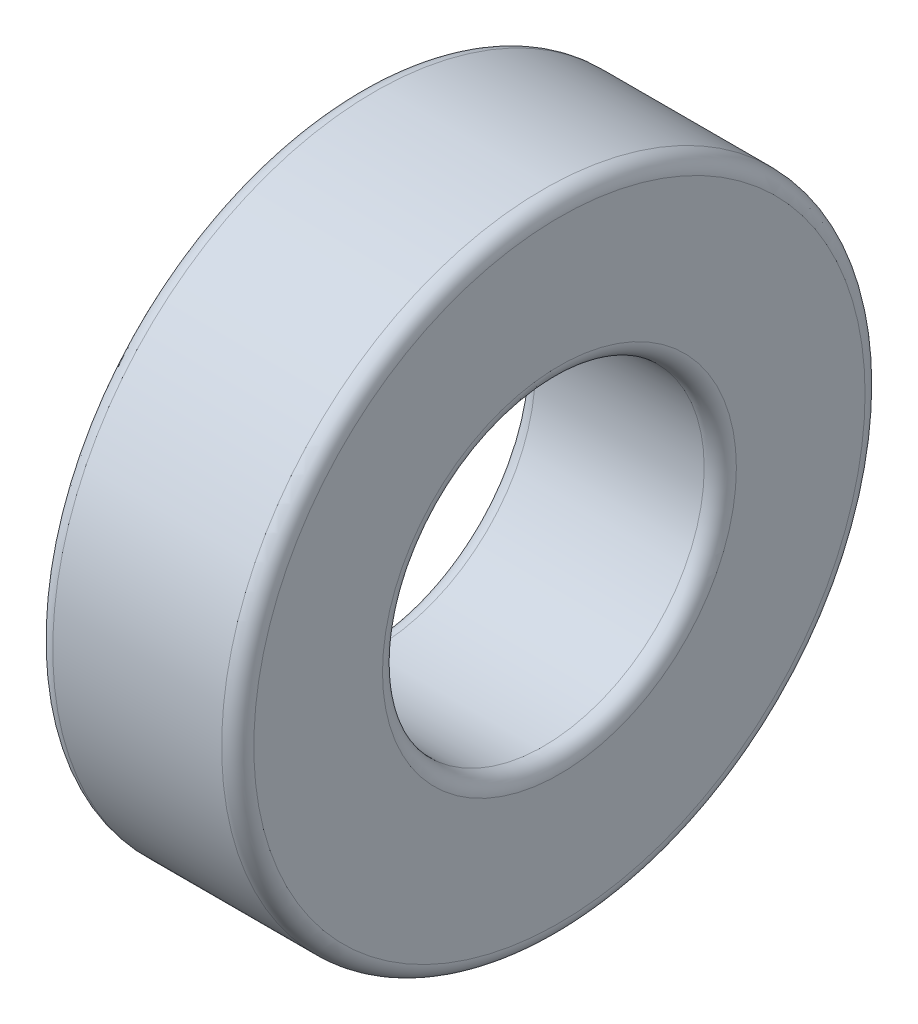
ISO-10303-21;
HEADER;
FILE_DESCRIPTION(('STEP AP214'),'2;1');
FILE_NAME('part.step','',(''),(''),'','','');
FILE_SCHEMA(('AUTOMOTIVE_DESIGN { 1 0 10303 214 1 1 1 1 }'));
ENDSEC;
DATA;
#1=APPLICATION_CONTEXT('core data for automotive mechanical design processes');
#2=APPLICATION_PROTOCOL_DEFINITION('international standard','automotive_design',2000,#1);
#3=PRODUCT_CONTEXT('',#1,'mechanical');
#4=PRODUCT('Part','Part','',(#3));
#5=PRODUCT_RELATED_PRODUCT_CATEGORY('part','',(#4));
#6=PRODUCT_DEFINITION_FORMATION('','',#4);
#7=PRODUCT_DEFINITION_CONTEXT('part definition',#1,'design');
#8=PRODUCT_DEFINITION('design','',#6,#7);
#9=PRODUCT_DEFINITION_SHAPE('','',#8);
#10=(LENGTH_UNIT() NAMED_UNIT(*) SI_UNIT(.MILLI.,.METRE.));
#11=(NAMED_UNIT(*) PLANE_ANGLE_UNIT() SI_UNIT($,.RADIAN.));
#12=(NAMED_UNIT(*) SI_UNIT($,.STERADIAN.) SOLID_ANGLE_UNIT());
#13=UNCERTAINTY_MEASURE_WITH_UNIT(LENGTH_MEASURE(1.E-05),#10,'distance_accuracy_value','');
#14=(GEOMETRIC_REPRESENTATION_CONTEXT(3) GLOBAL_UNCERTAINTY_ASSIGNED_CONTEXT((#13)) GLOBAL_UNIT_ASSIGNED_CONTEXT((#10,
#11,#12)) REPRESENTATION_CONTEXT('',''));
#15=CARTESIAN_POINT('',(0.,0.,0.));
#16=DIRECTION('',(0.,0.,1.));
#17=DIRECTION('',(1.,0.,0.));
#18=AXIS2_PLACEMENT_3D('',#15,#16,#17);
#19=CARTESIAN_POINT('',(5.,0.,0.));
#20=DIRECTION('',(1.,0.,0.));
#21=DIRECTION('',(0.,0.,-1.));
#22=AXIS2_PLACEMENT_3D('',#19,#20,#21);
#23=PLANE('',#22);
#24=CARTESIAN_POINT('',(5.,0.,0.));
#25=DIRECTION('',(1.,0.,0.));
#26=DIRECTION('',(0.,0.,-1.));
#27=AXIS2_PLACEMENT_3D('',#24,#25,#26);
#28=CIRCLE('',#27,4.4);
#29=CARTESIAN_POINT('',(5.,0.,-4.4));
#30=VERTEX_POINT('',#29);
#31=EDGE_CURVE('E10',#30,#30,#28,.F.);
#32=ORIENTED_EDGE('',*,*,#31,.T.);
#33=EDGE_LOOP('',(#32));
#34=FACE_BOUND('',#33,.T.);
#35=CARTESIAN_POINT('',(5.,0.,0.));
#36=DIRECTION('',(1.,0.,0.));
#37=DIRECTION('',(0.,0.,-1.));
#38=AXIS2_PLACEMENT_3D('',#35,#36,#37);
#39=CIRCLE('',#38,7.6);
#40=CARTESIAN_POINT('',(5.,0.,-7.6));
#41=VERTEX_POINT('',#40);
#42=EDGE_CURVE('E49',#41,#41,#39,.T.);
#43=ORIENTED_EDGE('',*,*,#42,.T.);
#44=EDGE_LOOP('',(#43));
#45=FACE_BOUND('',#44,.T.);
#46=ADVANCED_FACE('F41',(#34,#45),#23,.T.);
#47=CARTESIAN_POINT('',(0.,0.,0.));
#48=DIRECTION('',(1.,0.,0.));
#49=DIRECTION('',(0.,0.,-1.));
#50=AXIS2_PLACEMENT_3D('',#47,#48,#49);
#51=PLANE('',#50);
#52=CARTESIAN_POINT('',(0.,0.,0.));
#53=DIRECTION('',(1.,0.,0.));
#54=DIRECTION('',(0.,0.,-1.));
#55=AXIS2_PLACEMENT_3D('',#52,#53,#54);
#56=CIRCLE('',#55,7.6);
#57=CARTESIAN_POINT('',(0.,0.,-7.6));
#58=VERTEX_POINT('',#57);
#59=EDGE_CURVE('E65',#58,#58,#56,.F.);
#60=ORIENTED_EDGE('',*,*,#59,.T.);
#61=EDGE_LOOP('',(#60));
#62=FACE_BOUND('',#61,.T.);
#63=CARTESIAN_POINT('',(0.,0.,0.));
#64=DIRECTION('',(1.,0.,0.));
#65=DIRECTION('',(0.,0.,-1.));
#66=AXIS2_PLACEMENT_3D('',#63,#64,#65);
#67=CIRCLE('',#66,4.4);
#68=CARTESIAN_POINT('',(0.,0.,-4.4));
#69=VERTEX_POINT('',#68);
#70=EDGE_CURVE('E69',#69,#69,#67,.T.);
#71=ORIENTED_EDGE('',*,*,#70,.T.);
#72=EDGE_LOOP('',(#71));
#73=FACE_BOUND('',#72,.T.);
#74=ADVANCED_FACE('F93',(#62,#73),#51,.F.);
#75=CARTESIAN_POINT('',(5.,0.,0.));
#76=DIRECTION('',(-1.,0.,0.));
#77=DIRECTION('',(0.,0.,1.));
#78=AXIS2_PLACEMENT_3D('',#75,#76,#77);
#79=CYLINDRICAL_SURFACE('',#78,8.);
#80=CARTESIAN_POINT('',(0.4,0.,0.));
#81=DIRECTION('',(1.,0.,0.));
#82=DIRECTION('',(0.,0.,-1.));
#83=AXIS2_PLACEMENT_3D('',#80,#81,#82);
#84=CIRCLE('',#83,8.);
#85=CARTESIAN_POINT('',(0.4,0.,-8.));
#86=VERTEX_POINT('',#85);
#87=EDGE_CURVE('E73',#86,#86,#84,.T.);
#88=ORIENTED_EDGE('',*,*,#87,.T.);
#89=EDGE_LOOP('',(#88));
#90=FACE_BOUND('',#89,.T.);
#91=CARTESIAN_POINT('',(4.6,0.,0.));
#92=DIRECTION('',(1.,0.,0.));
#93=DIRECTION('',(0.,0.,-1.));
#94=AXIS2_PLACEMENT_3D('',#91,#92,#93);
#95=CIRCLE('',#94,8.);
#96=CARTESIAN_POINT('',(4.6,0.,-8.));
#97=VERTEX_POINT('',#96);
#98=EDGE_CURVE('E77',#97,#97,#95,.F.);
#99=ORIENTED_EDGE('',*,*,#98,.T.);
#100=EDGE_LOOP('',(#99));
#101=FACE_BOUND('',#100,.T.);
#102=ADVANCED_FACE('F82',(#90,#101),#79,.T.);
#103=CARTESIAN_POINT('',(5.,0.,0.));
#104=DIRECTION('',(-1.,0.,0.));
#105=DIRECTION('',(0.,0.,1.));
#106=AXIS2_PLACEMENT_3D('',#103,#104,#105);
#107=CYLINDRICAL_SURFACE('',#106,4.);
#108=CARTESIAN_POINT('',(0.4,0.,0.));
#109=DIRECTION('',(1.,0.,0.));
#110=DIRECTION('',(0.,0.,-1.));
#111=AXIS2_PLACEMENT_3D('',#108,#109,#110);
#112=CIRCLE('',#111,4.);
#113=CARTESIAN_POINT('',(0.4,0.,-4.));
#114=VERTEX_POINT('',#113);
#115=EDGE_CURVE('E54',#114,#114,#112,.F.);
#116=ORIENTED_EDGE('',*,*,#115,.T.);
#117=EDGE_LOOP('',(#116));
#118=FACE_BOUND('',#117,.T.);
#119=CARTESIAN_POINT('',(4.6,0.,0.));
#120=DIRECTION('',(1.,0.,0.));
#121=DIRECTION('',(0.,0.,-1.));
#122=AXIS2_PLACEMENT_3D('',#119,#120,#121);
#123=CIRCLE('',#122,4.);
#124=CARTESIAN_POINT('',(4.6,0.,-4.));
#125=VERTEX_POINT('',#124);
#126=EDGE_CURVE('E59',#125,#125,#123,.T.);
#127=ORIENTED_EDGE('',*,*,#126,.T.);
#128=EDGE_LOOP('',(#127));
#129=FACE_BOUND('',#128,.T.);
#130=ADVANCED_FACE('F101',(#118,#129),#107,.F.);
#131=CARTESIAN_POINT('',(0.4,0.,0.));
#132=DIRECTION('',(1.,0.,0.));
#133=DIRECTION('',(0.,0.,-1.));
#134=AXIS2_PLACEMENT_3D('',#131,#132,#133);
#135=TOROIDAL_SURFACE('',#134,7.6,0.4);
#136=ORIENTED_EDGE('',*,*,#59,.F.);
#137=EDGE_LOOP('',(#136));
#138=FACE_BOUND('',#137,.T.);
#139=ORIENTED_EDGE('',*,*,#87,.F.);
#140=EDGE_LOOP('',(#139));
#141=FACE_BOUND('',#140,.T.);
#142=ADVANCED_FACE('F106',(#138,#141),#135,.T.);
#143=CARTESIAN_POINT('',(0.4,0.,0.));
#144=DIRECTION('',(1.,0.,0.));
#145=DIRECTION('',(0.,0.,-1.));
#146=AXIS2_PLACEMENT_3D('',#143,#144,#145);
#147=TOROIDAL_SURFACE('',#146,4.4,0.4);
#148=ORIENTED_EDGE('',*,*,#115,.F.);
#149=EDGE_LOOP('',(#148));
#150=FACE_BOUND('',#149,.T.);
#151=ORIENTED_EDGE('',*,*,#70,.F.);
#152=EDGE_LOOP('',(#151));
#153=FACE_BOUND('',#152,.T.);
#154=ADVANCED_FACE('F90',(#150,#153),#147,.T.);
#155=CARTESIAN_POINT('',(4.6,0.,0.));
#156=DIRECTION('',(1.,0.,0.));
#157=DIRECTION('',(0.,0.,-1.));
#158=AXIS2_PLACEMENT_3D('',#155,#156,#157);
#159=TOROIDAL_SURFACE('',#158,4.4,0.4);
#160=ORIENTED_EDGE('',*,*,#31,.F.);
#161=EDGE_LOOP('',(#160));
#162=FACE_BOUND('',#161,.T.);
#163=ORIENTED_EDGE('',*,*,#126,.F.);
#164=EDGE_LOOP('',(#163));
#165=FACE_BOUND('',#164,.T.);
#166=ADVANCED_FACE('F86',(#162,#165),#159,.T.);
#167=CARTESIAN_POINT('',(4.6,0.,0.));
#168=DIRECTION('',(1.,0.,0.));
#169=DIRECTION('',(0.,0.,-1.));
#170=AXIS2_PLACEMENT_3D('',#167,#168,#169);
#171=TOROIDAL_SURFACE('',#170,7.6,0.4);
#172=ORIENTED_EDGE('',*,*,#98,.F.);
#173=EDGE_LOOP('',(#172));
#174=FACE_BOUND('',#173,.T.);
#175=ORIENTED_EDGE('',*,*,#42,.F.);
#176=EDGE_LOOP('',(#175));
#177=FACE_BOUND('',#176,.T.);
#178=ADVANCED_FACE('F43',(#174,#177),#171,.T.);
#179=CLOSED_SHELL('',(#46,#74,#102,#130,#142,#154,#166,#178));
#180=MANIFOLD_SOLID_BREP('B2',#179);
#181=ADVANCED_BREP_SHAPE_REPRESENTATION('',(#18,#180),#14);
#182=SHAPE_DEFINITION_REPRESENTATION(#9,#181);
ENDSEC;
END-ISO-10303-21;
